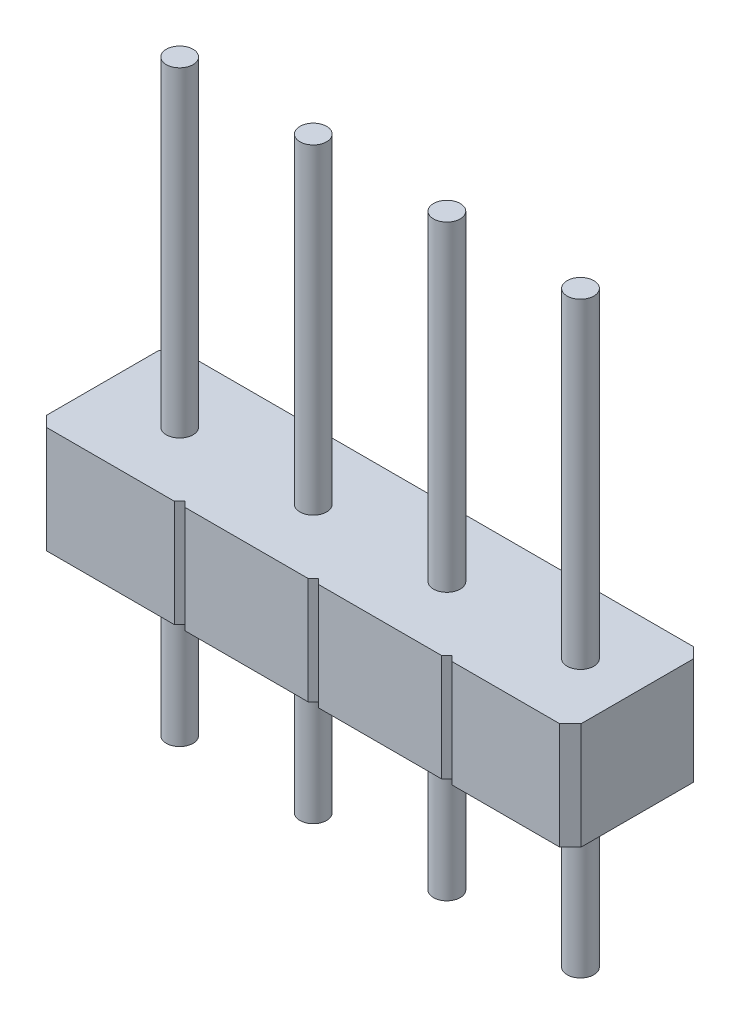
ISO-10303-21;
HEADER;
FILE_DESCRIPTION(('STEP AP214'),'2;1');
FILE_NAME('part.step','',(''),(''),'','','');
FILE_SCHEMA(('AUTOMOTIVE_DESIGN { 1 0 10303 214 1 1 1 1 }'));
ENDSEC;
DATA;
#1=APPLICATION_CONTEXT('core data for automotive mechanical design processes');
#2=APPLICATION_PROTOCOL_DEFINITION('international standard','automotive_design',2000,#1);
#3=PRODUCT_CONTEXT('',#1,'mechanical');
#4=PRODUCT('Part','Part','',(#3));
#5=PRODUCT_RELATED_PRODUCT_CATEGORY('part','',(#4));
#6=PRODUCT_DEFINITION_FORMATION('','',#4);
#7=PRODUCT_DEFINITION_CONTEXT('part definition',#1,'design');
#8=PRODUCT_DEFINITION('design','',#6,#7);
#9=PRODUCT_DEFINITION_SHAPE('','',#8);
#10=(LENGTH_UNIT() NAMED_UNIT(*) SI_UNIT(.MILLI.,.METRE.));
#11=(NAMED_UNIT(*) PLANE_ANGLE_UNIT() SI_UNIT($,.RADIAN.));
#12=(NAMED_UNIT(*) SI_UNIT($,.STERADIAN.) SOLID_ANGLE_UNIT());
#13=UNCERTAINTY_MEASURE_WITH_UNIT(LENGTH_MEASURE(1.E-05),#10,'distance_accuracy_value','');
#14=(GEOMETRIC_REPRESENTATION_CONTEXT(3) GLOBAL_UNCERTAINTY_ASSIGNED_CONTEXT((#13)) GLOBAL_UNIT_ASSIGNED_CONTEXT((#10,
#11,#12)) REPRESENTATION_CONTEXT('',''));
#15=CARTESIAN_POINT('',(0.,0.,0.));
#16=DIRECTION('',(0.,0.,1.));
#17=DIRECTION('',(1.,0.,0.));
#18=AXIS2_PLACEMENT_3D('',#15,#16,#17);
#19=CARTESIAN_POINT('',(0.,2.,0.));
#20=DIRECTION('',(0.,-1.,0.));
#21=DIRECTION('',(0.,0.,-1.));
#22=AXIS2_PLACEMENT_3D('',#19,#20,#21);
#23=PLANE('',#22);
#24=DIRECTION('',(-0.707106781186547,0.,0.707106781186548));
#25=VECTOR('',#24,1.);
#26=CARTESIAN_POINT('',(-5.,2.,-1.05));
#27=LINE('',#26,#25);
#28=CARTESIAN_POINT('',(-4.8,2.,-1.25));
#29=VERTEX_POINT('',#28);
#30=CARTESIAN_POINT('',(-5.,2.,-1.05));
#31=VERTEX_POINT('',#30);
#32=EDGE_CURVE('E288',#29,#31,#27,.T.);
#33=ORIENTED_EDGE('',*,*,#32,.T.);
#34=DIRECTION('',(0.,0.,1.));
#35=VECTOR('',#34,1.);
#36=CARTESIAN_POINT('',(-5.,2.,-1.05));
#37=LINE('',#36,#35);
#38=CARTESIAN_POINT('',(-5.,2.,1.05));
#39=VERTEX_POINT('',#38);
#40=EDGE_CURVE('E146',#31,#39,#37,.T.);
#41=ORIENTED_EDGE('',*,*,#40,.T.);
#42=DIRECTION('',(0.707106781186547,0.,0.707106781186548));
#43=VECTOR('',#42,1.);
#44=CARTESIAN_POINT('',(-5.,2.,1.05));
#45=LINE('',#44,#43);
#46=CARTESIAN_POINT('',(-4.8,2.,1.25));
#47=VERTEX_POINT('',#46);
#48=EDGE_CURVE('E357',#39,#47,#45,.T.);
#49=ORIENTED_EDGE('',*,*,#48,.T.);
#50=DIRECTION('',(1.,0.,0.));
#51=VECTOR('',#50,1.);
#52=CARTESIAN_POINT('',(-4.8,2.,1.25));
#53=LINE('',#52,#51);
#54=CARTESIAN_POINT('',(-2.41138997367375,2.,1.25));
#55=VERTEX_POINT('',#54);
#56=EDGE_CURVE('E376',#47,#55,#53,.T.);
#57=ORIENTED_EDGE('',*,*,#56,.T.);
#58=DIRECTION('',(0.707106781186545,0.,-0.70710678118655));
#59=VECTOR('',#58,1.);
#60=CARTESIAN_POINT('',(-2.41138997367375,2.,1.25));
#61=LINE('',#60,#59);
#62=CARTESIAN_POINT('',(-2.31138997367375,2.,1.15));
#63=VERTEX_POINT('',#62);
#64=EDGE_CURVE('E373',#55,#63,#61,.T.);
#65=ORIENTED_EDGE('',*,*,#64,.T.);
#66=DIRECTION('',(0.707106781186548,0.,0.707106781186547));
#67=VECTOR('',#66,1.);
#68=CARTESIAN_POINT('',(-2.31138997367375,2.,1.15));
#69=LINE('',#68,#67);
#70=CARTESIAN_POINT('',(-2.21138997367375,2.,1.25));
#71=VERTEX_POINT('',#70);
#72=EDGE_CURVE('E375',#63,#71,#69,.T.);
#73=ORIENTED_EDGE('',*,*,#72,.T.);
#74=DIRECTION('',(1.,0.,0.));
#75=VECTOR('',#74,1.);
#76=CARTESIAN_POINT('',(-2.21138997367375,2.,1.25));
#77=LINE('',#76,#75);
#78=CARTESIAN_POINT('',(0.0886100263262443,2.,1.25));
#79=VERTEX_POINT('',#78);
#80=EDGE_CURVE('E378',#71,#79,#77,.T.);
#81=ORIENTED_EDGE('',*,*,#80,.T.);
#82=DIRECTION('',(0.707106781186546,0.,-0.707106781186549));
#83=VECTOR('',#82,1.);
#84=CARTESIAN_POINT('',(0.0886100263262443,2.,1.25));
#85=LINE('',#84,#83);
#86=CARTESIAN_POINT('',(0.188610026326244,2.,1.15));
#87=VERTEX_POINT('',#86);
#88=EDGE_CURVE('E384',#79,#87,#85,.T.);
#89=ORIENTED_EDGE('',*,*,#88,.T.);
#90=DIRECTION('',(0.707106781186549,0.,0.707106781186546));
#91=VECTOR('',#90,1.);
#92=CARTESIAN_POINT('',(0.188610026326244,2.,1.15));
#93=LINE('',#92,#91);
#94=CARTESIAN_POINT('',(0.288610026326245,2.,1.25));
#95=VERTEX_POINT('',#94);
#96=EDGE_CURVE('E386',#87,#95,#93,.T.);
#97=ORIENTED_EDGE('',*,*,#96,.T.);
#98=DIRECTION('',(1.,0.,0.));
#99=VECTOR('',#98,1.);
#100=CARTESIAN_POINT('',(0.288610026326245,2.,1.25));
#101=LINE('',#100,#99);
#102=CARTESIAN_POINT('',(2.58861002632625,2.,1.25));
#103=VERTEX_POINT('',#102);
#104=EDGE_CURVE('E388',#95,#103,#101,.T.);
#105=ORIENTED_EDGE('',*,*,#104,.T.);
#106=DIRECTION('',(0.707106781186546,0.,-0.707106781186549));
#107=VECTOR('',#106,1.);
#108=CARTESIAN_POINT('',(2.58861002632625,2.,1.25));
#109=LINE('',#108,#107);
#110=CARTESIAN_POINT('',(2.68861002632624,2.,1.15));
#111=VERTEX_POINT('',#110);
#112=EDGE_CURVE('E390',#103,#111,#109,.T.);
#113=ORIENTED_EDGE('',*,*,#112,.T.);
#114=DIRECTION('',(0.707106781186549,0.,0.707106781186546));
#115=VECTOR('',#114,1.);
#116=CARTESIAN_POINT('',(2.68861002632624,2.,1.15));
#117=LINE('',#116,#115);
#118=CARTESIAN_POINT('',(2.78861002632624,2.,1.25));
#119=VERTEX_POINT('',#118);
#120=EDGE_CURVE('E392',#111,#119,#117,.T.);
#121=ORIENTED_EDGE('',*,*,#120,.T.);
#122=DIRECTION('',(1.,0.,0.));
#123=VECTOR('',#122,1.);
#124=CARTESIAN_POINT('',(2.78861002632624,2.,1.25));
#125=LINE('',#124,#123);
#126=CARTESIAN_POINT('',(4.8,2.,1.25));
#127=VERTEX_POINT('',#126);
#128=EDGE_CURVE('E394',#119,#127,#125,.T.);
#129=ORIENTED_EDGE('',*,*,#128,.T.);
#130=DIRECTION('',(0.707106781186547,0.,-0.707106781186548));
#131=VECTOR('',#130,1.);
#132=CARTESIAN_POINT('',(4.8,2.,1.25));
#133=LINE('',#132,#131);
#134=CARTESIAN_POINT('',(5.,2.,1.05));
#135=VERTEX_POINT('',#134);
#136=EDGE_CURVE('E396',#127,#135,#133,.T.);
#137=ORIENTED_EDGE('',*,*,#136,.T.);
#138=DIRECTION('',(0.,0.,-1.));
#139=VECTOR('',#138,1.);
#140=CARTESIAN_POINT('',(5.,2.,-1.05));
#141=LINE('',#140,#139);
#142=CARTESIAN_POINT('',(5.,2.,-1.05));
#143=VERTEX_POINT('',#142);
#144=EDGE_CURVE('E398',#135,#143,#141,.T.);
#145=ORIENTED_EDGE('',*,*,#144,.T.);
#146=DIRECTION('',(-0.707106781186547,0.,-0.707106781186548));
#147=VECTOR('',#146,1.);
#148=CARTESIAN_POINT('',(4.8,2.,-1.25));
#149=LINE('',#148,#147);
#150=CARTESIAN_POINT('',(4.8,2.,-1.25));
#151=VERTEX_POINT('',#150);
#152=EDGE_CURVE('E400',#143,#151,#149,.T.);
#153=ORIENTED_EDGE('',*,*,#152,.T.);
#154=DIRECTION('',(-1.,0.,0.));
#155=VECTOR('',#154,1.);
#156=CARTESIAN_POINT('',(2.78861002632624,2.,-1.25));
#157=LINE('',#156,#155);
#158=CARTESIAN_POINT('',(2.78861002632624,2.,-1.25));
#159=VERTEX_POINT('',#158);
#160=EDGE_CURVE('E402',#151,#159,#157,.T.);
#161=ORIENTED_EDGE('',*,*,#160,.T.);
#162=DIRECTION('',(-0.707106781186547,0.,0.707106781186548));
#163=VECTOR('',#162,1.);
#164=CARTESIAN_POINT('',(2.68861002632624,2.,-1.15));
#165=LINE('',#164,#163);
#166=CARTESIAN_POINT('',(2.68861002632624,2.,-1.15));
#167=VERTEX_POINT('',#166);
#168=EDGE_CURVE('E404',#159,#167,#165,.T.);
#169=ORIENTED_EDGE('',*,*,#168,.T.);
#170=DIRECTION('',(-0.707106781186547,0.,-0.707106781186548));
#171=VECTOR('',#170,1.);
#172=CARTESIAN_POINT('',(2.58861002632624,2.,-1.25));
#173=LINE('',#172,#171);
#174=CARTESIAN_POINT('',(2.58861002632624,2.,-1.25));
#175=VERTEX_POINT('',#174);
#176=EDGE_CURVE('E406',#167,#175,#173,.T.);
#177=ORIENTED_EDGE('',*,*,#176,.T.);
#178=DIRECTION('',(-1.,0.,0.));
#179=VECTOR('',#178,1.);
#180=CARTESIAN_POINT('',(0.288610026326243,2.,-1.25));
#181=LINE('',#180,#179);
#182=CARTESIAN_POINT('',(0.288610026326243,2.,-1.25));
#183=VERTEX_POINT('',#182);
#184=EDGE_CURVE('E408',#175,#183,#181,.T.);
#185=ORIENTED_EDGE('',*,*,#184,.T.);
#186=DIRECTION('',(-0.707106781186547,0.,0.707106781186549));
#187=VECTOR('',#186,1.);
#188=CARTESIAN_POINT('',(0.188610026326244,2.,-1.15));
#189=LINE('',#188,#187);
#190=CARTESIAN_POINT('',(0.188610026326244,2.,-1.15));
#191=VERTEX_POINT('',#190);
#192=EDGE_CURVE('E410',#183,#191,#189,.T.);
#193=ORIENTED_EDGE('',*,*,#192,.T.);
#194=DIRECTION('',(-0.707106781186549,0.,-0.707106781186546));
#195=VECTOR('',#194,1.);
#196=CARTESIAN_POINT('',(0.0886100263262439,2.,-1.25));
#197=LINE('',#196,#195);
#198=CARTESIAN_POINT('',(0.0886100263262439,2.,-1.25));
#199=VERTEX_POINT('',#198);
#200=EDGE_CURVE('E412',#191,#199,#197,.T.);
#201=ORIENTED_EDGE('',*,*,#200,.T.);
#202=DIRECTION('',(-1.,0.,0.));
#203=VECTOR('',#202,1.);
#204=CARTESIAN_POINT('',(-2.2107197566744,2.,-1.25));
#205=LINE('',#204,#203);
#206=CARTESIAN_POINT('',(-2.2107197566744,2.,-1.25));
#207=VERTEX_POINT('',#206);
#208=EDGE_CURVE('E219',#199,#207,#205,.T.);
#209=ORIENTED_EDGE('',*,*,#208,.T.);
#210=DIRECTION('',(-0.619239922198396,0.,0.785201833133191));
#211=VECTOR('',#210,1.);
#212=CARTESIAN_POINT('',(-2.31138997367376,2.,-1.12234925253336));
#213=LINE('',#212,#211);
#214=CARTESIAN_POINT('',(-2.31138997367376,2.,-1.12234925253336));
#215=VERTEX_POINT('',#214);
#216=EDGE_CURVE('E213',#207,#215,#213,.T.);
#217=ORIENTED_EDGE('',*,*,#216,.T.);
#218=DIRECTION('',(-0.619239922198393,0.,-0.785201833133194));
#219=VECTOR('',#218,1.);
#220=CARTESIAN_POINT('',(-2.41206019067311,2.,-1.25));
#221=LINE('',#220,#219);
#222=CARTESIAN_POINT('',(-2.41206019067311,2.,-1.25));
#223=VERTEX_POINT('',#222);
#224=EDGE_CURVE('E217',#215,#223,#221,.T.);
#225=ORIENTED_EDGE('',*,*,#224,.T.);
#226=DIRECTION('',(-1.,0.,0.));
#227=VECTOR('',#226,1.);
#228=CARTESIAN_POINT('',(-4.8,2.,-1.25));
#229=LINE('',#228,#227);
#230=EDGE_CURVE('E49',#223,#29,#229,.T.);
#231=ORIENTED_EDGE('',*,*,#230,.T.);
#232=EDGE_LOOP('',(#33,#41,#49,#57,#65,#73,#81,#89,#97,#105,#113,#121,#129,#137,#145,#153,#161,
#169,#177,#185,#193,#201,#209,#217,#225,#231));
#233=FACE_BOUND('',#232,.T.);
#234=CARTESIAN_POINT('',(-3.56138997367376,2.,0.));
#235=DIRECTION('',(0.,1.,0.));
#236=DIRECTION('',(0.,0.,1.));
#237=AXIS2_PLACEMENT_3D('',#234,#235,#236);
#238=CIRCLE('',#237,0.25);
#239=CARTESIAN_POINT('',(-3.56138997367376,2.,0.25));
#240=VERTEX_POINT('',#239);
#241=EDGE_CURVE('E241',#240,#240,#238,.T.);
#242=ORIENTED_EDGE('',*,*,#241,.F.);
#243=EDGE_LOOP('',(#242));
#244=FACE_BOUND('',#243,.T.);
#245=CARTESIAN_POINT('',(-1.06138997367376,2.,0.));
#246=DIRECTION('',(0.,1.,0.));
#247=DIRECTION('',(0.,0.,1.));
#248=AXIS2_PLACEMENT_3D('',#245,#246,#247);
#249=CIRCLE('',#248,0.25);
#250=CARTESIAN_POINT('',(-1.06138997367376,2.,0.25));
#251=VERTEX_POINT('',#250);
#252=EDGE_CURVE('E540',#251,#251,#249,.T.);
#253=ORIENTED_EDGE('',*,*,#252,.F.);
#254=EDGE_LOOP('',(#253));
#255=FACE_BOUND('',#254,.T.);
#256=CARTESIAN_POINT('',(1.43861002632624,2.,0.));
#257=DIRECTION('',(0.,1.,0.));
#258=DIRECTION('',(0.,0.,1.));
#259=AXIS2_PLACEMENT_3D('',#256,#257,#258);
#260=CIRCLE('',#259,0.25);
#261=CARTESIAN_POINT('',(1.43861002632624,2.,0.25));
#262=VERTEX_POINT('',#261);
#263=EDGE_CURVE('E537',#262,#262,#260,.T.);
#264=ORIENTED_EDGE('',*,*,#263,.F.);
#265=EDGE_LOOP('',(#264));
#266=FACE_BOUND('',#265,.T.);
#267=CARTESIAN_POINT('',(3.93861002632624,2.,0.));
#268=DIRECTION('',(0.,1.,0.));
#269=DIRECTION('',(0.,0.,1.));
#270=AXIS2_PLACEMENT_3D('',#267,#268,#269);
#271=CIRCLE('',#270,0.250000000000001);
#272=CARTESIAN_POINT('',(3.93861002632624,2.,0.250000000000001));
#273=VERTEX_POINT('',#272);
#274=EDGE_CURVE('E534',#273,#273,#271,.T.);
#275=ORIENTED_EDGE('',*,*,#274,.F.);
#276=EDGE_LOOP('',(#275));
#277=FACE_BOUND('',#276,.T.);
#278=ADVANCED_FACE('F32',(#233,#244,#255,#266,#277),#23,.F.);
#279=CARTESIAN_POINT('',(0.,0.,0.));
#280=DIRECTION('',(0.,-1.,0.));
#281=DIRECTION('',(0.,0.,-1.));
#282=AXIS2_PLACEMENT_3D('',#279,#280,#281);
#283=PLANE('',#282);
#284=CARTESIAN_POINT('',(1.43861002632624,0.,0.));
#285=DIRECTION('',(0.,-1.,0.));
#286=DIRECTION('',(0.,0.,-1.));
#287=AXIS2_PLACEMENT_3D('',#284,#285,#286);
#288=CIRCLE('',#287,0.25);
#289=CARTESIAN_POINT('',(1.43861002632624,0.,-0.25));
#290=VERTEX_POINT('',#289);
#291=EDGE_CURVE('E513',#290,#290,#288,.T.);
#292=ORIENTED_EDGE('',*,*,#291,.F.);
#293=EDGE_LOOP('',(#292));
#294=FACE_BOUND('',#293,.T.);
#295=CARTESIAN_POINT('',(-3.56138997367376,0.,0.));
#296=DIRECTION('',(0.,-1.,0.));
#297=DIRECTION('',(0.,0.,-1.));
#298=AXIS2_PLACEMENT_3D('',#295,#296,#297);
#299=CIRCLE('',#298,0.25);
#300=CARTESIAN_POINT('',(-3.56138997367376,0.,-0.25));
#301=VERTEX_POINT('',#300);
#302=EDGE_CURVE('E531',#301,#301,#299,.T.);
#303=ORIENTED_EDGE('',*,*,#302,.F.);
#304=EDGE_LOOP('',(#303));
#305=FACE_BOUND('',#304,.T.);
#306=DIRECTION('',(-0.707106781186547,0.,0.707106781186548));
#307=VECTOR('',#306,1.);
#308=CARTESIAN_POINT('',(-5.,0.,-1.05));
#309=LINE('',#308,#307);
#310=CARTESIAN_POINT('',(-4.8,0.,-1.25));
#311=VERTEX_POINT('',#310);
#312=CARTESIAN_POINT('',(-5.,0.,-1.05));
#313=VERTEX_POINT('',#312);
#314=EDGE_CURVE('E237',#311,#313,#309,.T.);
#315=ORIENTED_EDGE('',*,*,#314,.F.);
#316=DIRECTION('',(-1.,0.,0.));
#317=VECTOR('',#316,1.);
#318=CARTESIAN_POINT('',(-4.8,0.,-1.25));
#319=LINE('',#318,#317);
#320=CARTESIAN_POINT('',(-2.41206019067311,0.,-1.25));
#321=VERTEX_POINT('',#320);
#322=EDGE_CURVE('E138',#321,#311,#319,.T.);
#323=ORIENTED_EDGE('',*,*,#322,.F.);
#324=DIRECTION('',(-0.619239922198393,0.,-0.785201833133194));
#325=VECTOR('',#324,1.);
#326=CARTESIAN_POINT('',(-2.41206019067311,0.,-1.25));
#327=LINE('',#326,#325);
#328=CARTESIAN_POINT('',(-2.31138997367376,0.,-1.12234925253336));
#329=VERTEX_POINT('',#328);
#330=EDGE_CURVE('E132',#329,#321,#327,.T.);
#331=ORIENTED_EDGE('',*,*,#330,.F.);
#332=DIRECTION('',(-0.619239922198396,0.,0.785201833133191));
#333=VECTOR('',#332,1.);
#334=CARTESIAN_POINT('',(-2.31138997367376,0.,-1.12234925253336));
#335=LINE('',#334,#333);
#336=CARTESIAN_POINT('',(-2.2107197566744,0.,-1.25));
#337=VERTEX_POINT('',#336);
#338=EDGE_CURVE('E227',#337,#329,#335,.T.);
#339=ORIENTED_EDGE('',*,*,#338,.F.);
#340=DIRECTION('',(-1.,0.,0.));
#341=VECTOR('',#340,1.);
#342=CARTESIAN_POINT('',(-2.2107197566744,0.,-1.25));
#343=LINE('',#342,#341);
#344=CARTESIAN_POINT('',(0.0886100263262439,0.,-1.25));
#345=VERTEX_POINT('',#344);
#346=EDGE_CURVE('E283',#345,#337,#343,.T.);
#347=ORIENTED_EDGE('',*,*,#346,.F.);
#348=DIRECTION('',(-0.707106781186549,0.,-0.707106781186546));
#349=VECTOR('',#348,1.);
#350=CARTESIAN_POINT('',(0.0886100263262439,0.,-1.25));
#351=LINE('',#350,#349);
#352=CARTESIAN_POINT('',(0.188610026326244,0.,-1.15));
#353=VERTEX_POINT('',#352);
#354=EDGE_CURVE('E281',#353,#345,#351,.T.);
#355=ORIENTED_EDGE('',*,*,#354,.F.);
#356=DIRECTION('',(-0.707106781186547,0.,0.707106781186549));
#357=VECTOR('',#356,1.);
#358=CARTESIAN_POINT('',(0.188610026326244,0.,-1.15));
#359=LINE('',#358,#357);
#360=CARTESIAN_POINT('',(0.288610026326243,0.,-1.25));
#361=VERTEX_POINT('',#360);
#362=EDGE_CURVE('E279',#361,#353,#359,.T.);
#363=ORIENTED_EDGE('',*,*,#362,.F.);
#364=DIRECTION('',(-1.,0.,0.));
#365=VECTOR('',#364,1.);
#366=CARTESIAN_POINT('',(0.288610026326243,0.,-1.25));
#367=LINE('',#366,#365);
#368=CARTESIAN_POINT('',(2.58861002632624,0.,-1.25));
#369=VERTEX_POINT('',#368);
#370=EDGE_CURVE('E277',#369,#361,#367,.T.);
#371=ORIENTED_EDGE('',*,*,#370,.F.);
#372=DIRECTION('',(-0.707106781186547,0.,-0.707106781186548));
#373=VECTOR('',#372,1.);
#374=CARTESIAN_POINT('',(2.58861002632624,0.,-1.25));
#375=LINE('',#374,#373);
#376=CARTESIAN_POINT('',(2.68861002632624,0.,-1.15));
#377=VERTEX_POINT('',#376);
#378=EDGE_CURVE('E275',#377,#369,#375,.T.);
#379=ORIENTED_EDGE('',*,*,#378,.F.);
#380=DIRECTION('',(-0.707106781186547,0.,0.707106781186548));
#381=VECTOR('',#380,1.);
#382=CARTESIAN_POINT('',(2.68861002632624,0.,-1.15));
#383=LINE('',#382,#381);
#384=CARTESIAN_POINT('',(2.78861002632624,0.,-1.25));
#385=VERTEX_POINT('',#384);
#386=EDGE_CURVE('E273',#385,#377,#383,.T.);
#387=ORIENTED_EDGE('',*,*,#386,.F.);
#388=DIRECTION('',(-1.,0.,0.));
#389=VECTOR('',#388,1.);
#390=CARTESIAN_POINT('',(2.78861002632624,0.,-1.25));
#391=LINE('',#390,#389);
#392=CARTESIAN_POINT('',(4.8,0.,-1.25));
#393=VERTEX_POINT('',#392);
#394=EDGE_CURVE('E271',#393,#385,#391,.T.);
#395=ORIENTED_EDGE('',*,*,#394,.F.);
#396=DIRECTION('',(-0.707106781186547,0.,-0.707106781186548));
#397=VECTOR('',#396,1.);
#398=CARTESIAN_POINT('',(4.8,0.,-1.25));
#399=LINE('',#398,#397);
#400=CARTESIAN_POINT('',(5.,0.,-1.05));
#401=VERTEX_POINT('',#400);
#402=EDGE_CURVE('E269',#401,#393,#399,.T.);
#403=ORIENTED_EDGE('',*,*,#402,.F.);
#404=DIRECTION('',(0.,0.,-1.));
#405=VECTOR('',#404,1.);
#406=CARTESIAN_POINT('',(5.,0.,-1.05));
#407=LINE('',#406,#405);
#408=CARTESIAN_POINT('',(5.,0.,1.05));
#409=VERTEX_POINT('',#408);
#410=EDGE_CURVE('E267',#409,#401,#407,.T.);
#411=ORIENTED_EDGE('',*,*,#410,.F.);
#412=DIRECTION('',(0.707106781186547,0.,-0.707106781186548));
#413=VECTOR('',#412,1.);
#414=CARTESIAN_POINT('',(4.8,0.,1.25));
#415=LINE('',#414,#413);
#416=CARTESIAN_POINT('',(4.8,0.,1.25));
#417=VERTEX_POINT('',#416);
#418=EDGE_CURVE('E265',#417,#409,#415,.T.);
#419=ORIENTED_EDGE('',*,*,#418,.F.);
#420=DIRECTION('',(1.,0.,0.));
#421=VECTOR('',#420,1.);
#422=CARTESIAN_POINT('',(2.78861002632624,0.,1.25));
#423=LINE('',#422,#421);
#424=CARTESIAN_POINT('',(2.78861002632624,0.,1.25));
#425=VERTEX_POINT('',#424);
#426=EDGE_CURVE('E263',#425,#417,#423,.T.);
#427=ORIENTED_EDGE('',*,*,#426,.F.);
#428=DIRECTION('',(0.707106781186549,0.,0.707106781186546));
#429=VECTOR('',#428,1.);
#430=CARTESIAN_POINT('',(2.68861002632624,0.,1.15));
#431=LINE('',#430,#429);
#432=CARTESIAN_POINT('',(2.68861002632624,0.,1.15));
#433=VERTEX_POINT('',#432);
#434=EDGE_CURVE('E261',#433,#425,#431,.T.);
#435=ORIENTED_EDGE('',*,*,#434,.F.);
#436=DIRECTION('',(0.707106781186546,0.,-0.707106781186549));
#437=VECTOR('',#436,1.);
#438=CARTESIAN_POINT('',(2.58861002632625,0.,1.25));
#439=LINE('',#438,#437);
#440=CARTESIAN_POINT('',(2.58861002632625,0.,1.25));
#441=VERTEX_POINT('',#440);
#442=EDGE_CURVE('E259',#441,#433,#439,.T.);
#443=ORIENTED_EDGE('',*,*,#442,.F.);
#444=DIRECTION('',(1.,0.,0.));
#445=VECTOR('',#444,1.);
#446=CARTESIAN_POINT('',(0.288610026326245,0.,1.25));
#447=LINE('',#446,#445);
#448=CARTESIAN_POINT('',(0.288610026326245,0.,1.25));
#449=VERTEX_POINT('',#448);
#450=EDGE_CURVE('E257',#449,#441,#447,.T.);
#451=ORIENTED_EDGE('',*,*,#450,.F.);
#452=DIRECTION('',(0.707106781186549,0.,0.707106781186546));
#453=VECTOR('',#452,1.);
#454=CARTESIAN_POINT('',(0.188610026326244,0.,1.15));
#455=LINE('',#454,#453);
#456=CARTESIAN_POINT('',(0.188610026326244,0.,1.15));
#457=VERTEX_POINT('',#456);
#458=EDGE_CURVE('E255',#457,#449,#455,.T.);
#459=ORIENTED_EDGE('',*,*,#458,.F.);
#460=DIRECTION('',(0.707106781186546,0.,-0.707106781186549));
#461=VECTOR('',#460,1.);
#462=CARTESIAN_POINT('',(0.0886100263262443,0.,1.25));
#463=LINE('',#462,#461);
#464=CARTESIAN_POINT('',(0.0886100263262443,0.,1.25));
#465=VERTEX_POINT('',#464);
#466=EDGE_CURVE('E253',#465,#457,#463,.T.);
#467=ORIENTED_EDGE('',*,*,#466,.F.);
#468=DIRECTION('',(1.,0.,0.));
#469=VECTOR('',#468,1.);
#470=CARTESIAN_POINT('',(-2.21138997367375,0.,1.25));
#471=LINE('',#470,#469);
#472=CARTESIAN_POINT('',(-2.21138997367375,0.,1.25));
#473=VERTEX_POINT('',#472);
#474=EDGE_CURVE('E251',#473,#465,#471,.T.);
#475=ORIENTED_EDGE('',*,*,#474,.F.);
#476=DIRECTION('',(0.707106781186548,0.,0.707106781186547));
#477=VECTOR('',#476,1.);
#478=CARTESIAN_POINT('',(-2.31138997367375,0.,1.15));
#479=LINE('',#478,#477);
#480=CARTESIAN_POINT('',(-2.31138997367375,0.,1.15));
#481=VERTEX_POINT('',#480);
#482=EDGE_CURVE('E249',#481,#473,#479,.T.);
#483=ORIENTED_EDGE('',*,*,#482,.F.);
#484=DIRECTION('',(0.707106781186545,0.,-0.70710678118655));
#485=VECTOR('',#484,1.);
#486=CARTESIAN_POINT('',(-2.41138997367375,0.,1.25));
#487=LINE('',#486,#485);
#488=CARTESIAN_POINT('',(-2.41138997367375,0.,1.25));
#489=VERTEX_POINT('',#488);
#490=EDGE_CURVE('E247',#489,#481,#487,.T.);
#491=ORIENTED_EDGE('',*,*,#490,.F.);
#492=DIRECTION('',(1.,0.,0.));
#493=VECTOR('',#492,1.);
#494=CARTESIAN_POINT('',(-4.8,0.,1.25));
#495=LINE('',#494,#493);
#496=CARTESIAN_POINT('',(-4.8,0.,1.25));
#497=VERTEX_POINT('',#496);
#498=EDGE_CURVE('E245',#497,#489,#495,.T.);
#499=ORIENTED_EDGE('',*,*,#498,.F.);
#500=DIRECTION('',(0.707106781186547,0.,0.707106781186548));
#501=VECTOR('',#500,1.);
#502=CARTESIAN_POINT('',(-5.,0.,1.05));
#503=LINE('',#502,#501);
#504=CARTESIAN_POINT('',(-5.,0.,1.05));
#505=VERTEX_POINT('',#504);
#506=EDGE_CURVE('E243',#505,#497,#503,.T.);
#507=ORIENTED_EDGE('',*,*,#506,.F.);
#508=DIRECTION('',(0.,0.,1.));
#509=VECTOR('',#508,1.);
#510=CARTESIAN_POINT('',(-5.,0.,-1.05));
#511=LINE('',#510,#509);
#512=EDGE_CURVE('E240',#313,#505,#511,.T.);
#513=ORIENTED_EDGE('',*,*,#512,.F.);
#514=EDGE_LOOP('',(#315,#323,#331,#339,#347,#355,#363,#371,#379,#387,#395,#403,#411,#419,#427,
#435,#443,#451,#459,#467,#475,#483,#491,#499,#507,#513));
#515=FACE_BOUND('',#514,.T.);
#516=CARTESIAN_POINT('',(-1.06138997367376,0.,0.));
#517=DIRECTION('',(0.,-1.,0.));
#518=DIRECTION('',(0.,0.,-1.));
#519=AXIS2_PLACEMENT_3D('',#516,#517,#518);
#520=CIRCLE('',#519,0.25);
#521=CARTESIAN_POINT('',(-1.06138997367376,0.,-0.25));
#522=VERTEX_POINT('',#521);
#523=EDGE_CURVE('E522',#522,#522,#520,.T.);
#524=ORIENTED_EDGE('',*,*,#523,.F.);
#525=EDGE_LOOP('',(#524));
#526=FACE_BOUND('',#525,.T.);
#527=CARTESIAN_POINT('',(3.93861002632624,0.,0.));
#528=DIRECTION('',(0.,-1.,0.));
#529=DIRECTION('',(0.,0.,-1.));
#530=AXIS2_PLACEMENT_3D('',#527,#528,#529);
#531=CIRCLE('',#530,0.250000000000001);
#532=CARTESIAN_POINT('',(3.93861002632624,0.,-0.250000000000001));
#533=VERTEX_POINT('',#532);
#534=EDGE_CURVE('E502',#533,#533,#531,.T.);
#535=ORIENTED_EDGE('',*,*,#534,.F.);
#536=EDGE_LOOP('',(#535));
#537=FACE_BOUND('',#536,.T.);
#538=ADVANCED_FACE('F361',(#294,#305,#515,#526,#537),#283,.T.);
#539=CARTESIAN_POINT('',(-5.,2.,-1.05));
#540=DIRECTION('',(0.707106781186548,0.,0.707106781186547));
#541=DIRECTION('',(0.707106781186547,0.,-0.707106781186548));
#542=AXIS2_PLACEMENT_3D('',#539,#540,#541);
#543=PLANE('',#542);
#544=ORIENTED_EDGE('',*,*,#314,.T.);
#545=DIRECTION('',(0.,-1.,0.));
#546=VECTOR('',#545,1.);
#547=CARTESIAN_POINT('',(-5.,2.,-1.05));
#548=LINE('',#547,#546);
#549=EDGE_CURVE('E11',#31,#313,#548,.T.);
#550=ORIENTED_EDGE('',*,*,#549,.F.);
#551=ORIENTED_EDGE('',*,*,#32,.F.);
#552=DIRECTION('',(0.,-1.,0.));
#553=VECTOR('',#552,1.);
#554=CARTESIAN_POINT('',(-4.8,2.,-1.25));
#555=LINE('',#554,#553);
#556=EDGE_CURVE('E233',#29,#311,#555,.T.);
#557=ORIENTED_EDGE('',*,*,#556,.T.);
#558=EDGE_LOOP('',(#544,#550,#551,#557));
#559=FACE_BOUND('',#558,.T.);
#560=ADVANCED_FACE('F34',(#559),#543,.F.);
#561=CARTESIAN_POINT('',(-5.,2.,-1.05));
#562=DIRECTION('',(1.,0.,0.));
#563=DIRECTION('',(0.,0.,-1.));
#564=AXIS2_PLACEMENT_3D('',#561,#562,#563);
#565=PLANE('',#564);
#566=ORIENTED_EDGE('',*,*,#512,.T.);
#567=DIRECTION('',(0.,-1.,0.));
#568=VECTOR('',#567,1.);
#569=CARTESIAN_POINT('',(-5.,2.,1.05));
#570=LINE('',#569,#568);
#571=EDGE_CURVE('E41',#39,#505,#570,.T.);
#572=ORIENTED_EDGE('',*,*,#571,.F.);
#573=ORIENTED_EDGE('',*,*,#40,.F.);
#574=ORIENTED_EDGE('',*,*,#549,.T.);
#575=EDGE_LOOP('',(#566,#572,#573,#574));
#576=FACE_BOUND('',#575,.T.);
#577=ADVANCED_FACE('F842',(#576),#565,.F.);
#578=CARTESIAN_POINT('',(-5.,2.,1.05));
#579=DIRECTION('',(0.707106781186548,0.,-0.707106781186547));
#580=DIRECTION('',(-0.707106781186547,0.,-0.707106781186548));
#581=AXIS2_PLACEMENT_3D('',#578,#579,#580);
#582=PLANE('',#581);
#583=ORIENTED_EDGE('',*,*,#506,.T.);
#584=DIRECTION('',(0.,-1.,0.));
#585=VECTOR('',#584,1.);
#586=CARTESIAN_POINT('',(-4.8,2.,1.25));
#587=LINE('',#586,#585);
#588=EDGE_CURVE('E349',#47,#497,#587,.T.);
#589=ORIENTED_EDGE('',*,*,#588,.F.);
#590=ORIENTED_EDGE('',*,*,#48,.F.);
#591=ORIENTED_EDGE('',*,*,#571,.T.);
#592=EDGE_LOOP('',(#583,#589,#590,#591));
#593=FACE_BOUND('',#592,.T.);
#594=ADVANCED_FACE('F355',(#593),#582,.F.);
#595=CARTESIAN_POINT('',(-4.8,2.,1.25));
#596=DIRECTION('',(0.,0.,-1.));
#597=DIRECTION('',(-1.,0.,0.));
#598=AXIS2_PLACEMENT_3D('',#595,#596,#597);
#599=PLANE('',#598);
#600=ORIENTED_EDGE('',*,*,#498,.T.);
#601=DIRECTION('',(0.,-1.,0.));
#602=VECTOR('',#601,1.);
#603=CARTESIAN_POINT('',(-2.41138997367375,2.,1.25));
#604=LINE('',#603,#602);
#605=EDGE_CURVE('E346',#55,#489,#604,.T.);
#606=ORIENTED_EDGE('',*,*,#605,.F.);
#607=ORIENTED_EDGE('',*,*,#56,.F.);
#608=ORIENTED_EDGE('',*,*,#588,.T.);
#609=EDGE_LOOP('',(#600,#606,#607,#608));
#610=FACE_BOUND('',#609,.T.);
#611=ADVANCED_FACE('F367',(#610),#599,.F.);
#612=CARTESIAN_POINT('',(-2.41138997367375,2.,1.25));
#613=DIRECTION('',(-0.70710678118655,0.,-0.707106781186545));
#614=DIRECTION('',(-0.707106781186545,0.,0.70710678118655));
#615=AXIS2_PLACEMENT_3D('',#612,#613,#614);
#616=PLANE('',#615);
#617=ORIENTED_EDGE('',*,*,#490,.T.);
#618=DIRECTION('',(0.,-1.,0.));
#619=VECTOR('',#618,1.);
#620=CARTESIAN_POINT('',(-2.31138997367375,2.,1.15));
#621=LINE('',#620,#619);
#622=EDGE_CURVE('E343',#63,#481,#621,.T.);
#623=ORIENTED_EDGE('',*,*,#622,.F.);
#624=ORIENTED_EDGE('',*,*,#64,.F.);
#625=ORIENTED_EDGE('',*,*,#605,.T.);
#626=EDGE_LOOP('',(#617,#623,#624,#625));
#627=FACE_BOUND('',#626,.T.);
#628=ADVANCED_FACE('F371',(#627),#616,.F.);
#629=CARTESIAN_POINT('',(-2.31138997367375,2.,1.15));
#630=DIRECTION('',(0.707106781186547,0.,-0.707106781186548));
#631=DIRECTION('',(-0.707106781186548,0.,-0.707106781186547));
#632=AXIS2_PLACEMENT_3D('',#629,#630,#631);
#633=PLANE('',#632);
#634=ORIENTED_EDGE('',*,*,#482,.T.);
#635=DIRECTION('',(0.,-1.,0.));
#636=VECTOR('',#635,1.);
#637=CARTESIAN_POINT('',(-2.21138997367375,2.,1.25));
#638=LINE('',#637,#636);
#639=EDGE_CURVE('E340',#71,#473,#638,.T.);
#640=ORIENTED_EDGE('',*,*,#639,.F.);
#641=ORIENTED_EDGE('',*,*,#72,.F.);
#642=ORIENTED_EDGE('',*,*,#622,.T.);
#643=EDGE_LOOP('',(#634,#640,#641,#642));
#644=FACE_BOUND('',#643,.T.);
#645=ADVANCED_FACE('F811',(#644),#633,.F.);
#646=CARTESIAN_POINT('',(-2.21138997367375,2.,1.25));
#647=DIRECTION('',(0.,0.,-1.));
#648=DIRECTION('',(-1.,0.,0.));
#649=AXIS2_PLACEMENT_3D('',#646,#647,#648);
#650=PLANE('',#649);
#651=ORIENTED_EDGE('',*,*,#474,.T.);
#652=DIRECTION('',(0.,-1.,0.));
#653=VECTOR('',#652,1.);
#654=CARTESIAN_POINT('',(0.0886100263262443,2.,1.25));
#655=LINE('',#654,#653);
#656=EDGE_CURVE('E337',#79,#465,#655,.T.);
#657=ORIENTED_EDGE('',*,*,#656,.F.);
#658=ORIENTED_EDGE('',*,*,#80,.F.);
#659=ORIENTED_EDGE('',*,*,#639,.T.);
#660=EDGE_LOOP('',(#651,#657,#658,#659));
#661=FACE_BOUND('',#660,.T.);
#662=ADVANCED_FACE('F802',(#661),#650,.F.);
#663=CARTESIAN_POINT('',(0.0886100263262443,2.,1.25));
#664=DIRECTION('',(-0.707106781186549,0.,-0.707106781186546));
#665=DIRECTION('',(-0.707106781186546,0.,0.707106781186549));
#666=AXIS2_PLACEMENT_3D('',#663,#664,#665);
#667=PLANE('',#666);
#668=ORIENTED_EDGE('',*,*,#466,.T.);
#669=DIRECTION('',(0.,-1.,0.));
#670=VECTOR('',#669,1.);
#671=CARTESIAN_POINT('',(0.188610026326244,2.,1.15));
#672=LINE('',#671,#670);
#673=EDGE_CURVE('E334',#87,#457,#672,.T.);
#674=ORIENTED_EDGE('',*,*,#673,.F.);
#675=ORIENTED_EDGE('',*,*,#88,.F.);
#676=ORIENTED_EDGE('',*,*,#656,.T.);
#677=EDGE_LOOP('',(#668,#674,#675,#676));
#678=FACE_BOUND('',#677,.T.);
#679=ADVANCED_FACE('F793',(#678),#667,.F.);
#680=CARTESIAN_POINT('',(0.188610026326244,2.,1.15));
#681=DIRECTION('',(0.707106781186546,0.,-0.707106781186549));
#682=DIRECTION('',(-0.707106781186549,0.,-0.707106781186546));
#683=AXIS2_PLACEMENT_3D('',#680,#681,#682);
#684=PLANE('',#683);
#685=ORIENTED_EDGE('',*,*,#458,.T.);
#686=DIRECTION('',(0.,-1.,0.));
#687=VECTOR('',#686,1.);
#688=CARTESIAN_POINT('',(0.288610026326245,2.,1.25));
#689=LINE('',#688,#687);
#690=EDGE_CURVE('E331',#95,#449,#689,.T.);
#691=ORIENTED_EDGE('',*,*,#690,.F.);
#692=ORIENTED_EDGE('',*,*,#96,.F.);
#693=ORIENTED_EDGE('',*,*,#673,.T.);
#694=EDGE_LOOP('',(#685,#691,#692,#693));
#695=FACE_BOUND('',#694,.T.);
#696=ADVANCED_FACE('F784',(#695),#684,.F.);
#697=CARTESIAN_POINT('',(0.288610026326245,2.,1.25));
#698=DIRECTION('',(0.,0.,-1.));
#699=DIRECTION('',(-1.,0.,0.));
#700=AXIS2_PLACEMENT_3D('',#697,#698,#699);
#701=PLANE('',#700);
#702=ORIENTED_EDGE('',*,*,#450,.T.);
#703=DIRECTION('',(0.,-1.,0.));
#704=VECTOR('',#703,1.);
#705=CARTESIAN_POINT('',(2.58861002632625,2.,1.25));
#706=LINE('',#705,#704);
#707=EDGE_CURVE('E328',#103,#441,#706,.T.);
#708=ORIENTED_EDGE('',*,*,#707,.F.);
#709=ORIENTED_EDGE('',*,*,#104,.F.);
#710=ORIENTED_EDGE('',*,*,#690,.T.);
#711=EDGE_LOOP('',(#702,#708,#709,#710));
#712=FACE_BOUND('',#711,.T.);
#713=ADVANCED_FACE('F775',(#712),#701,.F.);
#714=CARTESIAN_POINT('',(2.58861002632625,2.,1.25));
#715=DIRECTION('',(-0.707106781186549,0.,-0.707106781186546));
#716=DIRECTION('',(-0.707106781186546,0.,0.707106781186549));
#717=AXIS2_PLACEMENT_3D('',#714,#715,#716);
#718=PLANE('',#717);
#719=ORIENTED_EDGE('',*,*,#442,.T.);
#720=DIRECTION('',(0.,-1.,0.));
#721=VECTOR('',#720,1.);
#722=CARTESIAN_POINT('',(2.68861002632624,2.,1.15));
#723=LINE('',#722,#721);
#724=EDGE_CURVE('E325',#111,#433,#723,.T.);
#725=ORIENTED_EDGE('',*,*,#724,.F.);
#726=ORIENTED_EDGE('',*,*,#112,.F.);
#727=ORIENTED_EDGE('',*,*,#707,.T.);
#728=EDGE_LOOP('',(#719,#725,#726,#727));
#729=FACE_BOUND('',#728,.T.);
#730=ADVANCED_FACE('F766',(#729),#718,.F.);
#731=CARTESIAN_POINT('',(2.68861002632624,2.,1.15));
#732=DIRECTION('',(0.707106781186546,0.,-0.707106781186549));
#733=DIRECTION('',(-0.707106781186549,0.,-0.707106781186546));
#734=AXIS2_PLACEMENT_3D('',#731,#732,#733);
#735=PLANE('',#734);
#736=ORIENTED_EDGE('',*,*,#434,.T.);
#737=DIRECTION('',(0.,-1.,0.));
#738=VECTOR('',#737,1.);
#739=CARTESIAN_POINT('',(2.78861002632624,2.,1.25));
#740=LINE('',#739,#738);
#741=EDGE_CURVE('E322',#119,#425,#740,.T.);
#742=ORIENTED_EDGE('',*,*,#741,.F.);
#743=ORIENTED_EDGE('',*,*,#120,.F.);
#744=ORIENTED_EDGE('',*,*,#724,.T.);
#745=EDGE_LOOP('',(#736,#742,#743,#744));
#746=FACE_BOUND('',#745,.T.);
#747=ADVANCED_FACE('F757',(#746),#735,.F.);
#748=CARTESIAN_POINT('',(2.78861002632624,2.,1.25));
#749=DIRECTION('',(0.,0.,-1.));
#750=DIRECTION('',(-1.,0.,0.));
#751=AXIS2_PLACEMENT_3D('',#748,#749,#750);
#752=PLANE('',#751);
#753=ORIENTED_EDGE('',*,*,#426,.T.);
#754=DIRECTION('',(0.,-1.,0.));
#755=VECTOR('',#754,1.);
#756=CARTESIAN_POINT('',(4.8,2.,1.25));
#757=LINE('',#756,#755);
#758=EDGE_CURVE('E319',#127,#417,#757,.T.);
#759=ORIENTED_EDGE('',*,*,#758,.F.);
#760=ORIENTED_EDGE('',*,*,#128,.F.);
#761=ORIENTED_EDGE('',*,*,#741,.T.);
#762=EDGE_LOOP('',(#753,#759,#760,#761));
#763=FACE_BOUND('',#762,.T.);
#764=ADVANCED_FACE('F748',(#763),#752,.F.);
#765=CARTESIAN_POINT('',(4.8,2.,1.25));
#766=DIRECTION('',(-0.707106781186548,0.,-0.707106781186547));
#767=DIRECTION('',(-0.707106781186547,0.,0.707106781186548));
#768=AXIS2_PLACEMENT_3D('',#765,#766,#767);
#769=PLANE('',#768);
#770=ORIENTED_EDGE('',*,*,#418,.T.);
#771=DIRECTION('',(0.,-1.,0.));
#772=VECTOR('',#771,1.);
#773=CARTESIAN_POINT('',(5.,2.,1.05));
#774=LINE('',#773,#772);
#775=EDGE_CURVE('E316',#135,#409,#774,.T.);
#776=ORIENTED_EDGE('',*,*,#775,.F.);
#777=ORIENTED_EDGE('',*,*,#136,.F.);
#778=ORIENTED_EDGE('',*,*,#758,.T.);
#779=EDGE_LOOP('',(#770,#776,#777,#778));
#780=FACE_BOUND('',#779,.T.);
#781=ADVANCED_FACE('F739',(#780),#769,.F.);
#782=CARTESIAN_POINT('',(5.,2.,-1.05));
#783=DIRECTION('',(-1.,0.,0.));
#784=DIRECTION('',(0.,0.,1.));
#785=AXIS2_PLACEMENT_3D('',#782,#783,#784);
#786=PLANE('',#785);
#787=ORIENTED_EDGE('',*,*,#410,.T.);
#788=DIRECTION('',(0.,-1.,0.));
#789=VECTOR('',#788,1.);
#790=CARTESIAN_POINT('',(5.,2.,-1.05));
#791=LINE('',#790,#789);
#792=EDGE_CURVE('E313',#143,#401,#791,.T.);
#793=ORIENTED_EDGE('',*,*,#792,.F.);
#794=ORIENTED_EDGE('',*,*,#144,.F.);
#795=ORIENTED_EDGE('',*,*,#775,.T.);
#796=EDGE_LOOP('',(#787,#793,#794,#795));
#797=FACE_BOUND('',#796,.T.);
#798=ADVANCED_FACE('F730',(#797),#786,.F.);
#799=CARTESIAN_POINT('',(4.8,2.,-1.25));
#800=DIRECTION('',(-0.707106781186548,0.,0.707106781186547));
#801=DIRECTION('',(0.707106781186547,0.,0.707106781186548));
#802=AXIS2_PLACEMENT_3D('',#799,#800,#801);
#803=PLANE('',#802);
#804=ORIENTED_EDGE('',*,*,#402,.T.);
#805=DIRECTION('',(0.,-1.,0.));
#806=VECTOR('',#805,1.);
#807=CARTESIAN_POINT('',(4.8,2.,-1.25));
#808=LINE('',#807,#806);
#809=EDGE_CURVE('E310',#151,#393,#808,.T.);
#810=ORIENTED_EDGE('',*,*,#809,.F.);
#811=ORIENTED_EDGE('',*,*,#152,.F.);
#812=ORIENTED_EDGE('',*,*,#792,.T.);
#813=EDGE_LOOP('',(#804,#810,#811,#812));
#814=FACE_BOUND('',#813,.T.);
#815=ADVANCED_FACE('F721',(#814),#803,.F.);
#816=CARTESIAN_POINT('',(2.78861002632624,2.,-1.25));
#817=DIRECTION('',(0.,0.,1.));
#818=DIRECTION('',(1.,0.,0.));
#819=AXIS2_PLACEMENT_3D('',#816,#817,#818);
#820=PLANE('',#819);
#821=ORIENTED_EDGE('',*,*,#394,.T.);
#822=DIRECTION('',(0.,-1.,0.));
#823=VECTOR('',#822,1.);
#824=CARTESIAN_POINT('',(2.78861002632624,2.,-1.25));
#825=LINE('',#824,#823);
#826=EDGE_CURVE('E307',#159,#385,#825,.T.);
#827=ORIENTED_EDGE('',*,*,#826,.F.);
#828=ORIENTED_EDGE('',*,*,#160,.F.);
#829=ORIENTED_EDGE('',*,*,#809,.T.);
#830=EDGE_LOOP('',(#821,#827,#828,#829));
#831=FACE_BOUND('',#830,.T.);
#832=ADVANCED_FACE('F712',(#831),#820,.F.);
#833=CARTESIAN_POINT('',(2.68861002632624,2.,-1.15));
#834=DIRECTION('',(0.707106781186548,0.,0.707106781186547));
#835=DIRECTION('',(0.707106781186547,0.,-0.707106781186548));
#836=AXIS2_PLACEMENT_3D('',#833,#834,#835);
#837=PLANE('',#836);
#838=ORIENTED_EDGE('',*,*,#386,.T.);
#839=DIRECTION('',(0.,-1.,0.));
#840=VECTOR('',#839,1.);
#841=CARTESIAN_POINT('',(2.68861002632624,2.,-1.15));
#842=LINE('',#841,#840);
#843=EDGE_CURVE('E304',#167,#377,#842,.T.);
#844=ORIENTED_EDGE('',*,*,#843,.F.);
#845=ORIENTED_EDGE('',*,*,#168,.F.);
#846=ORIENTED_EDGE('',*,*,#826,.T.);
#847=EDGE_LOOP('',(#838,#844,#845,#846));
#848=FACE_BOUND('',#847,.T.);
#849=ADVANCED_FACE('F703',(#848),#837,.F.);
#850=CARTESIAN_POINT('',(2.58861002632624,2.,-1.25));
#851=DIRECTION('',(-0.707106781186548,0.,0.707106781186547));
#852=DIRECTION('',(0.707106781186547,0.,0.707106781186548));
#853=AXIS2_PLACEMENT_3D('',#850,#851,#852);
#854=PLANE('',#853);
#855=ORIENTED_EDGE('',*,*,#378,.T.);
#856=DIRECTION('',(0.,-1.,0.));
#857=VECTOR('',#856,1.);
#858=CARTESIAN_POINT('',(2.58861002632624,2.,-1.25));
#859=LINE('',#858,#857);
#860=EDGE_CURVE('E301',#175,#369,#859,.T.);
#861=ORIENTED_EDGE('',*,*,#860,.F.);
#862=ORIENTED_EDGE('',*,*,#176,.F.);
#863=ORIENTED_EDGE('',*,*,#843,.T.);
#864=EDGE_LOOP('',(#855,#861,#862,#863));
#865=FACE_BOUND('',#864,.T.);
#866=ADVANCED_FACE('F694',(#865),#854,.F.);
#867=CARTESIAN_POINT('',(0.288610026326243,2.,-1.25));
#868=DIRECTION('',(0.,0.,1.));
#869=DIRECTION('',(1.,0.,0.));
#870=AXIS2_PLACEMENT_3D('',#867,#868,#869);
#871=PLANE('',#870);
#872=ORIENTED_EDGE('',*,*,#370,.T.);
#873=DIRECTION('',(0.,-1.,0.));
#874=VECTOR('',#873,1.);
#875=CARTESIAN_POINT('',(0.288610026326243,2.,-1.25));
#876=LINE('',#875,#874);
#877=EDGE_CURVE('E298',#183,#361,#876,.T.);
#878=ORIENTED_EDGE('',*,*,#877,.F.);
#879=ORIENTED_EDGE('',*,*,#184,.F.);
#880=ORIENTED_EDGE('',*,*,#860,.T.);
#881=EDGE_LOOP('',(#872,#878,#879,#880));
#882=FACE_BOUND('',#881,.T.);
#883=ADVANCED_FACE('F685',(#882),#871,.F.);
#884=CARTESIAN_POINT('',(0.188610026326244,2.,-1.15));
#885=DIRECTION('',(0.707106781186549,0.,0.707106781186547));
#886=DIRECTION('',(0.707106781186547,0.,-0.707106781186549));
#887=AXIS2_PLACEMENT_3D('',#884,#885,#886);
#888=PLANE('',#887);
#889=ORIENTED_EDGE('',*,*,#362,.T.);
#890=DIRECTION('',(0.,-1.,0.));
#891=VECTOR('',#890,1.);
#892=CARTESIAN_POINT('',(0.188610026326244,2.,-1.15));
#893=LINE('',#892,#891);
#894=EDGE_CURVE('E295',#191,#353,#893,.T.);
#895=ORIENTED_EDGE('',*,*,#894,.F.);
#896=ORIENTED_EDGE('',*,*,#192,.F.);
#897=ORIENTED_EDGE('',*,*,#877,.T.);
#898=EDGE_LOOP('',(#889,#895,#896,#897));
#899=FACE_BOUND('',#898,.T.);
#900=ADVANCED_FACE('F677',(#899),#888,.F.);
#901=CARTESIAN_POINT('',(0.0886100263262439,2.,-1.25));
#902=DIRECTION('',(-0.707106781186546,0.,0.707106781186549));
#903=DIRECTION('',(0.707106781186549,0.,0.707106781186546));
#904=AXIS2_PLACEMENT_3D('',#901,#902,#903);
#905=PLANE('',#904);
#906=ORIENTED_EDGE('',*,*,#354,.T.);
#907=DIRECTION('',(0.,-1.,0.));
#908=VECTOR('',#907,1.);
#909=CARTESIAN_POINT('',(0.0886100263262439,2.,-1.25));
#910=LINE('',#909,#908);
#911=EDGE_CURVE('E292',#199,#345,#910,.T.);
#912=ORIENTED_EDGE('',*,*,#911,.F.);
#913=ORIENTED_EDGE('',*,*,#200,.F.);
#914=ORIENTED_EDGE('',*,*,#894,.T.);
#915=EDGE_LOOP('',(#906,#912,#913,#914));
#916=FACE_BOUND('',#915,.T.);
#917=ADVANCED_FACE('F418',(#916),#905,.F.);
#918=CARTESIAN_POINT('',(-2.2107197566744,2.,-1.25));
#919=DIRECTION('',(0.,0.,1.));
#920=DIRECTION('',(1.,0.,0.));
#921=AXIS2_PLACEMENT_3D('',#918,#919,#920);
#922=PLANE('',#921);
#923=ORIENTED_EDGE('',*,*,#346,.T.);
#924=DIRECTION('',(0.,-1.,0.));
#925=VECTOR('',#924,1.);
#926=CARTESIAN_POINT('',(-2.2107197566744,2.,-1.25));
#927=LINE('',#926,#925);
#928=EDGE_CURVE('E228',#207,#337,#927,.T.);
#929=ORIENTED_EDGE('',*,*,#928,.F.);
#930=ORIENTED_EDGE('',*,*,#208,.F.);
#931=ORIENTED_EDGE('',*,*,#911,.T.);
#932=EDGE_LOOP('',(#923,#929,#930,#931));
#933=FACE_BOUND('',#932,.T.);
#934=ADVANCED_FACE('F422',(#933),#922,.F.);
#935=CARTESIAN_POINT('',(-2.31138997367376,2.,-1.12234925253336));
#936=DIRECTION('',(0.785201833133191,0.,0.619239922198397));
#937=DIRECTION('',(0.619239922198397,0.,-0.785201833133191));
#938=AXIS2_PLACEMENT_3D('',#935,#936,#937);
#939=PLANE('',#938);
#940=ORIENTED_EDGE('',*,*,#338,.T.);
#941=DIRECTION('',(0.,-1.,0.));
#942=VECTOR('',#941,1.);
#943=CARTESIAN_POINT('',(-2.31138997367376,2.,-1.12234925253336));
#944=LINE('',#943,#942);
#945=EDGE_CURVE('E224',#215,#329,#944,.T.);
#946=ORIENTED_EDGE('',*,*,#945,.F.);
#947=ORIENTED_EDGE('',*,*,#216,.F.);
#948=ORIENTED_EDGE('',*,*,#928,.T.);
#949=EDGE_LOOP('',(#940,#946,#947,#948));
#950=FACE_BOUND('',#949,.T.);
#951=ADVANCED_FACE('F225',(#950),#939,.F.);
#952=CARTESIAN_POINT('',(-2.41206019067311,2.,-1.25));
#953=DIRECTION('',(-0.785201833133194,0.,0.619239922198393));
#954=DIRECTION('',(0.619239922198393,0.,0.785201833133194));
#955=AXIS2_PLACEMENT_3D('',#952,#953,#954);
#956=PLANE('',#955);
#957=ORIENTED_EDGE('',*,*,#330,.T.);
#958=DIRECTION('',(0.,-1.,0.));
#959=VECTOR('',#958,1.);
#960=CARTESIAN_POINT('',(-2.41206019067311,2.,-1.25));
#961=LINE('',#960,#959);
#962=EDGE_CURVE('E229',#223,#321,#961,.T.);
#963=ORIENTED_EDGE('',*,*,#962,.F.);
#964=ORIENTED_EDGE('',*,*,#224,.F.);
#965=ORIENTED_EDGE('',*,*,#945,.T.);
#966=EDGE_LOOP('',(#957,#963,#964,#965));
#967=FACE_BOUND('',#966,.T.);
#968=ADVANCED_FACE('F231',(#967),#956,.F.);
#969=CARTESIAN_POINT('',(-4.8,2.,-1.25));
#970=DIRECTION('',(0.,0.,1.));
#971=DIRECTION('',(1.,0.,0.));
#972=AXIS2_PLACEMENT_3D('',#969,#970,#971);
#973=PLANE('',#972);
#974=ORIENTED_EDGE('',*,*,#322,.T.);
#975=ORIENTED_EDGE('',*,*,#556,.F.);
#976=ORIENTED_EDGE('',*,*,#230,.F.);
#977=ORIENTED_EDGE('',*,*,#962,.T.);
#978=EDGE_LOOP('',(#974,#975,#976,#977));
#979=FACE_BOUND('',#978,.T.);
#980=ADVANCED_FACE('F426',(#979),#973,.F.);
#981=CARTESIAN_POINT('',(-3.56138997367376,-3.,0.));
#982=DIRECTION('',(0.,1.,0.));
#983=DIRECTION('',(0.,0.,1.));
#984=AXIS2_PLACEMENT_3D('',#981,#982,#983);
#985=PLANE('',#984);
#986=CARTESIAN_POINT('',(-3.56138997367376,-3.,0.));
#987=DIRECTION('',(0.,1.,0.));
#988=DIRECTION('',(0.,0.,1.));
#989=AXIS2_PLACEMENT_3D('',#986,#987,#988);
#990=CIRCLE('',#989,0.25);
#991=CARTESIAN_POINT('',(-3.56138997367376,-3.,0.25));
#992=VERTEX_POINT('',#991);
#993=EDGE_CURVE('E528',#992,#992,#990,.T.);
#994=ORIENTED_EDGE('',*,*,#993,.F.);
#995=EDGE_LOOP('',(#994));
#996=FACE_BOUND('',#995,.T.);
#997=ADVANCED_FACE('F428',(#996),#985,.F.);
#998=CARTESIAN_POINT('',(-3.56138997367376,-3.,0.));
#999=DIRECTION('',(0.,1.,0.));
#1000=DIRECTION('',(0.,0.,1.));
#1001=AXIS2_PLACEMENT_3D('',#998,#999,#1000);
#1002=CYLINDRICAL_SURFACE('',#1001,0.25);
#1003=ORIENTED_EDGE('',*,*,#302,.T.);
#1004=EDGE_LOOP('',(#1003));
#1005=FACE_BOUND('',#1004,.T.);
#1006=ORIENTED_EDGE('',*,*,#993,.T.);
#1007=EDGE_LOOP('',(#1006));
#1008=FACE_BOUND('',#1007,.T.);
#1009=ADVANCED_FACE('F434',(#1005,#1008),#1002,.T.);
#1010=CARTESIAN_POINT('',(-3.56138997367376,8.,0.));
#1011=DIRECTION('',(0.,1.,0.));
#1012=DIRECTION('',(0.,0.,1.));
#1013=AXIS2_PLACEMENT_3D('',#1010,#1011,#1012);
#1014=CIRCLE('',#1013,0.25);
#1015=CARTESIAN_POINT('',(-3.56138997367376,8.,0.25));
#1016=VERTEX_POINT('',#1015);
#1017=EDGE_CURVE('E525',#1016,#1016,#1014,.T.);
#1018=ORIENTED_EDGE('',*,*,#1017,.F.);
#1019=EDGE_LOOP('',(#1018));
#1020=FACE_BOUND('',#1019,.T.);
#1021=ORIENTED_EDGE('',*,*,#241,.T.);
#1022=EDGE_LOOP('',(#1021));
#1023=FACE_BOUND('',#1022,.T.);
#1024=ADVANCED_FACE('F447',(#1020,#1023),#1002,.T.);
#1025=CARTESIAN_POINT('',(-3.56138997367376,8.,0.));
#1026=DIRECTION('',(0.,1.,0.));
#1027=DIRECTION('',(0.,0.,1.));
#1028=AXIS2_PLACEMENT_3D('',#1025,#1026,#1027);
#1029=PLANE('',#1028);
#1030=ORIENTED_EDGE('',*,*,#1017,.T.);
#1031=EDGE_LOOP('',(#1030));
#1032=FACE_BOUND('',#1031,.T.);
#1033=ADVANCED_FACE('F450',(#1032),#1029,.T.);
#1034=CARTESIAN_POINT('',(-1.06138997367376,-3.,0.));
#1035=DIRECTION('',(0.,1.,0.));
#1036=DIRECTION('',(0.,0.,1.));
#1037=AXIS2_PLACEMENT_3D('',#1034,#1035,#1036);
#1038=PLANE('',#1037);
#1039=CARTESIAN_POINT('',(-1.06138997367376,-3.,0.));
#1040=DIRECTION('',(0.,1.,0.));
#1041=DIRECTION('',(0.,0.,1.));
#1042=AXIS2_PLACEMENT_3D('',#1039,#1040,#1041);
#1043=CIRCLE('',#1042,0.25);
#1044=CARTESIAN_POINT('',(-1.06138997367376,-3.,0.25));
#1045=VERTEX_POINT('',#1044);
#1046=EDGE_CURVE('E519',#1045,#1045,#1043,.T.);
#1047=ORIENTED_EDGE('',*,*,#1046,.F.);
#1048=EDGE_LOOP('',(#1047));
#1049=FACE_BOUND('',#1048,.T.);
#1050=ADVANCED_FACE('F453',(#1049),#1038,.F.);
#1051=CARTESIAN_POINT('',(-1.06138997367376,-3.,0.));
#1052=DIRECTION('',(0.,1.,0.));
#1053=DIRECTION('',(0.,0.,1.));
#1054=AXIS2_PLACEMENT_3D('',#1051,#1052,#1053);
#1055=CYLINDRICAL_SURFACE('',#1054,0.25);
#1056=ORIENTED_EDGE('',*,*,#523,.T.);
#1057=EDGE_LOOP('',(#1056));
#1058=FACE_BOUND('',#1057,.T.);
#1059=ORIENTED_EDGE('',*,*,#1046,.T.);
#1060=EDGE_LOOP('',(#1059));
#1061=FACE_BOUND('',#1060,.T.);
#1062=ADVANCED_FACE('F455',(#1058,#1061),#1055,.T.);
#1063=CARTESIAN_POINT('',(-1.06138997367376,8.,0.));
#1064=DIRECTION('',(0.,1.,0.));
#1065=DIRECTION('',(0.,0.,1.));
#1066=AXIS2_PLACEMENT_3D('',#1063,#1064,#1065);
#1067=CIRCLE('',#1066,0.25);
#1068=CARTESIAN_POINT('',(-1.06138997367376,8.,0.25));
#1069=VERTEX_POINT('',#1068);
#1070=EDGE_CURVE('E516',#1069,#1069,#1067,.T.);
#1071=ORIENTED_EDGE('',*,*,#1070,.F.);
#1072=EDGE_LOOP('',(#1071));
#1073=FACE_BOUND('',#1072,.T.);
#1074=ORIENTED_EDGE('',*,*,#252,.T.);
#1075=EDGE_LOOP('',(#1074));
#1076=FACE_BOUND('',#1075,.T.);
#1077=ADVANCED_FACE('F458',(#1073,#1076),#1055,.T.);
#1078=CARTESIAN_POINT('',(-1.06138997367376,8.,0.));
#1079=DIRECTION('',(0.,1.,0.));
#1080=DIRECTION('',(0.,0.,1.));
#1081=AXIS2_PLACEMENT_3D('',#1078,#1079,#1080);
#1082=PLANE('',#1081);
#1083=ORIENTED_EDGE('',*,*,#1070,.T.);
#1084=EDGE_LOOP('',(#1083));
#1085=FACE_BOUND('',#1084,.T.);
#1086=ADVANCED_FACE('F463',(#1085),#1082,.T.);
#1087=CARTESIAN_POINT('',(1.43861002632624,-3.,0.));
#1088=DIRECTION('',(0.,1.,0.));
#1089=DIRECTION('',(0.,0.,1.));
#1090=AXIS2_PLACEMENT_3D('',#1087,#1088,#1089);
#1091=PLANE('',#1090);
#1092=CARTESIAN_POINT('',(1.43861002632624,-3.,0.));
#1093=DIRECTION('',(0.,1.,0.));
#1094=DIRECTION('',(0.,0.,1.));
#1095=AXIS2_PLACEMENT_3D('',#1092,#1093,#1094);
#1096=CIRCLE('',#1095,0.25);
#1097=CARTESIAN_POINT('',(1.43861002632624,-3.,0.25));
#1098=VERTEX_POINT('',#1097);
#1099=EDGE_CURVE('E510',#1098,#1098,#1096,.T.);
#1100=ORIENTED_EDGE('',*,*,#1099,.F.);
#1101=EDGE_LOOP('',(#1100));
#1102=FACE_BOUND('',#1101,.T.);
#1103=ADVANCED_FACE('F466',(#1102),#1091,.F.);
#1104=CARTESIAN_POINT('',(1.43861002632624,-3.,0.));
#1105=DIRECTION('',(0.,1.,0.));
#1106=DIRECTION('',(0.,0.,1.));
#1107=AXIS2_PLACEMENT_3D('',#1104,#1105,#1106);
#1108=CYLINDRICAL_SURFACE('',#1107,0.25);
#1109=ORIENTED_EDGE('',*,*,#291,.T.);
#1110=EDGE_LOOP('',(#1109));
#1111=FACE_BOUND('',#1110,.T.);
#1112=ORIENTED_EDGE('',*,*,#1099,.T.);
#1113=EDGE_LOOP('',(#1112));
#1114=FACE_BOUND('',#1113,.T.);
#1115=ADVANCED_FACE('F468',(#1111,#1114),#1108,.T.);
#1116=CARTESIAN_POINT('',(1.43861002632624,8.,0.));
#1117=DIRECTION('',(0.,1.,0.));
#1118=DIRECTION('',(0.,0.,1.));
#1119=AXIS2_PLACEMENT_3D('',#1116,#1117,#1118);
#1120=CIRCLE('',#1119,0.25);
#1121=CARTESIAN_POINT('',(1.43861002632624,8.,0.25));
#1122=VERTEX_POINT('',#1121);
#1123=EDGE_CURVE('E507',#1122,#1122,#1120,.T.);
#1124=ORIENTED_EDGE('',*,*,#1123,.F.);
#1125=EDGE_LOOP('',(#1124));
#1126=FACE_BOUND('',#1125,.T.);
#1127=ORIENTED_EDGE('',*,*,#263,.T.);
#1128=EDGE_LOOP('',(#1127));
#1129=FACE_BOUND('',#1128,.T.);
#1130=ADVANCED_FACE('F471',(#1126,#1129),#1108,.T.);
#1131=CARTESIAN_POINT('',(1.43861002632624,8.,0.));
#1132=DIRECTION('',(0.,1.,0.));
#1133=DIRECTION('',(0.,0.,1.));
#1134=AXIS2_PLACEMENT_3D('',#1131,#1132,#1133);
#1135=PLANE('',#1134);
#1136=ORIENTED_EDGE('',*,*,#1123,.T.);
#1137=EDGE_LOOP('',(#1136));
#1138=FACE_BOUND('',#1137,.T.);
#1139=ADVANCED_FACE('F476',(#1138),#1135,.T.);
#1140=CARTESIAN_POINT('',(3.93861002632624,-3.,0.));
#1141=DIRECTION('',(0.,1.,0.));
#1142=DIRECTION('',(0.,0.,1.));
#1143=AXIS2_PLACEMENT_3D('',#1140,#1141,#1142);
#1144=PLANE('',#1143);
#1145=CARTESIAN_POINT('',(3.93861002632624,-3.,0.));
#1146=DIRECTION('',(0.,1.,0.));
#1147=DIRECTION('',(0.,0.,1.));
#1148=AXIS2_PLACEMENT_3D('',#1145,#1146,#1147);
#1149=CIRCLE('',#1148,0.250000000000001);
#1150=CARTESIAN_POINT('',(3.93861002632624,-3.,0.250000000000001));
#1151=VERTEX_POINT('',#1150);
#1152=EDGE_CURVE('E499',#1151,#1151,#1149,.T.);
#1153=ORIENTED_EDGE('',*,*,#1152,.F.);
#1154=EDGE_LOOP('',(#1153));
#1155=FACE_BOUND('',#1154,.T.);
#1156=ADVANCED_FACE('F479',(#1155),#1144,.F.);
#1157=CARTESIAN_POINT('',(3.93861002632624,-3.,0.));
#1158=DIRECTION('',(0.,1.,0.));
#1159=DIRECTION('',(0.,0.,1.));
#1160=AXIS2_PLACEMENT_3D('',#1157,#1158,#1159);
#1161=CYLINDRICAL_SURFACE('',#1160,0.250000000000001);
#1162=ORIENTED_EDGE('',*,*,#534,.T.);
#1163=EDGE_LOOP('',(#1162));
#1164=FACE_BOUND('',#1163,.T.);
#1165=ORIENTED_EDGE('',*,*,#1152,.T.);
#1166=EDGE_LOOP('',(#1165));
#1167=FACE_BOUND('',#1166,.T.);
#1168=ADVANCED_FACE('F481',(#1164,#1167),#1161,.T.);
#1169=CARTESIAN_POINT('',(3.93861002632624,8.,0.));
#1170=DIRECTION('',(0.,1.,0.));
#1171=DIRECTION('',(0.,0.,1.));
#1172=AXIS2_PLACEMENT_3D('',#1169,#1170,#1171);
#1173=CIRCLE('',#1172,0.250000000000001);
#1174=CARTESIAN_POINT('',(3.93861002632624,8.,0.250000000000001));
#1175=VERTEX_POINT('',#1174);
#1176=EDGE_CURVE('E498',#1175,#1175,#1173,.T.);
#1177=ORIENTED_EDGE('',*,*,#1176,.F.);
#1178=EDGE_LOOP('',(#1177));
#1179=FACE_BOUND('',#1178,.T.);
#1180=ORIENTED_EDGE('',*,*,#274,.T.);
#1181=EDGE_LOOP('',(#1180));
#1182=FACE_BOUND('',#1181,.T.);
#1183=ADVANCED_FACE('F484',(#1179,#1182),#1161,.T.);
#1184=CARTESIAN_POINT('',(3.93861002632624,8.,0.));
#1185=DIRECTION('',(0.,1.,0.));
#1186=DIRECTION('',(0.,0.,1.));
#1187=AXIS2_PLACEMENT_3D('',#1184,#1185,#1186);
#1188=PLANE('',#1187);
#1189=ORIENTED_EDGE('',*,*,#1176,.T.);
#1190=EDGE_LOOP('',(#1189));
#1191=FACE_BOUND('',#1190,.T.);
#1192=ADVANCED_FACE('F489',(#1191),#1188,.T.);
#1193=CLOSED_SHELL('',(#278,#538,#560,#577,#594,#611,#628,#645,#662,#679,#696,#713,#730,#747,
#764,#781,#798,#815,#832,#849,#866,#883,#900,#917,#934,#951,#968,#980,#997,#1009,#1024,#1033,
#1050,#1062,#1077,#1086,#1103,#1115,#1130,#1139,#1156,#1168,#1183,#1192));
#1194=MANIFOLD_SOLID_BREP('B2',#1193);
#1195=ADVANCED_BREP_SHAPE_REPRESENTATION('',(#18,#1194),#14);
#1196=SHAPE_DEFINITION_REPRESENTATION(#9,#1195);
ENDSEC;
END-ISO-10303-21;
